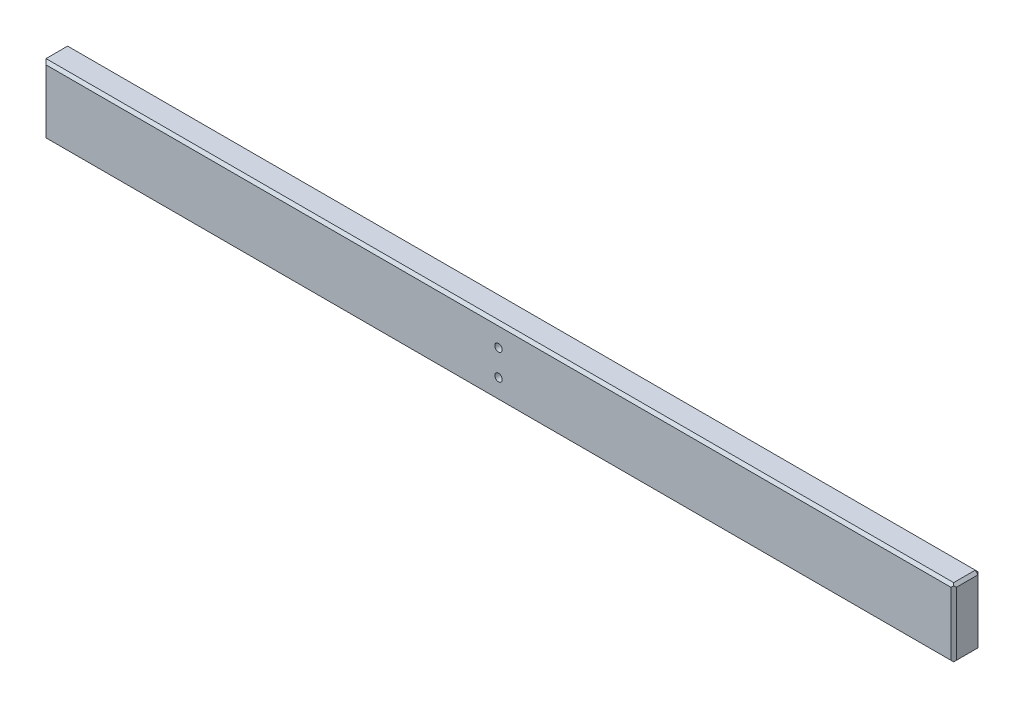
ISO-10303-21;
HEADER;
FILE_DESCRIPTION(('STEP AP214'),'2;1');
FILE_NAME('part.step','',(''),(''),'','','');
FILE_SCHEMA(('AUTOMOTIVE_DESIGN { 1 0 10303 214 1 1 1 1 }'));
ENDSEC;
DATA;
#1=APPLICATION_CONTEXT('core data for automotive mechanical design processes');
#2=APPLICATION_PROTOCOL_DEFINITION('international standard','automotive_design',2000,#1);
#3=PRODUCT_CONTEXT('',#1,'mechanical');
#4=PRODUCT('Part','Part','',(#3));
#5=PRODUCT_RELATED_PRODUCT_CATEGORY('part','',(#4));
#6=PRODUCT_DEFINITION_FORMATION('','',#4);
#7=PRODUCT_DEFINITION_CONTEXT('part definition',#1,'design');
#8=PRODUCT_DEFINITION('design','',#6,#7);
#9=PRODUCT_DEFINITION_SHAPE('','',#8);
#10=(LENGTH_UNIT() NAMED_UNIT(*) SI_UNIT(.MILLI.,.METRE.));
#11=(NAMED_UNIT(*) PLANE_ANGLE_UNIT() SI_UNIT($,.RADIAN.));
#12=(NAMED_UNIT(*) SI_UNIT($,.STERADIAN.) SOLID_ANGLE_UNIT());
#13=UNCERTAINTY_MEASURE_WITH_UNIT(LENGTH_MEASURE(1.E-05),#10,'distance_accuracy_value','');
#14=(GEOMETRIC_REPRESENTATION_CONTEXT(3) GLOBAL_UNCERTAINTY_ASSIGNED_CONTEXT((#13)) GLOBAL_UNIT_ASSIGNED_CONTEXT((#10,
#11,#12)) REPRESENTATION_CONTEXT('',''));
#15=CARTESIAN_POINT('',(0.,0.,0.));
#16=DIRECTION('',(0.,0.,1.));
#17=DIRECTION('',(1.,0.,0.));
#18=AXIS2_PLACEMENT_3D('',#15,#16,#17);
#19=CARTESIAN_POINT('',(336.7,25.4,20.));
#20=DIRECTION('',(-1.,0.,0.));
#21=DIRECTION('',(0.,0.,1.));
#22=AXIS2_PLACEMENT_3D('',#19,#20,#21);
#23=PLANE('',#22);
#24=DIRECTION('',(0.,-1.,0.));
#25=VECTOR('',#24,1.);
#26=CARTESIAN_POINT('',(336.7,-25.4,18.));
#27=LINE('',#26,#25);
#28=CARTESIAN_POINT('',(336.7,23.4,18.));
#29=VERTEX_POINT('',#28);
#30=CARTESIAN_POINT('',(336.7,-23.4000000000001,18.));
#31=VERTEX_POINT('',#30);
#32=EDGE_CURVE('E146',#29,#31,#27,.T.);
#33=ORIENTED_EDGE('',*,*,#32,.T.);
#34=DIRECTION('',(0.,0.,-1.));
#35=VECTOR('',#34,1.);
#36=CARTESIAN_POINT('',(336.7,-23.4000000000001,20.));
#37=LINE('',#36,#35);
#38=CARTESIAN_POINT('',(336.7,-23.4000000000001,1.99999999999995));
#39=VERTEX_POINT('',#38);
#40=EDGE_CURVE('E119',#31,#39,#37,.T.);
#41=ORIENTED_EDGE('',*,*,#40,.T.);
#42=DIRECTION('',(0.,1.,0.));
#43=VECTOR('',#42,1.);
#44=CARTESIAN_POINT('',(336.7,25.4,1.99999999999995));
#45=LINE('',#44,#43);
#46=CARTESIAN_POINT('',(336.7,23.4,1.99999999999995));
#47=VERTEX_POINT('',#46);
#48=EDGE_CURVE('E136',#39,#47,#45,.T.);
#49=ORIENTED_EDGE('',*,*,#48,.T.);
#50=DIRECTION('',(0.,0.,1.));
#51=VECTOR('',#50,1.);
#52=CARTESIAN_POINT('',(336.7,23.4,20.));
#53=LINE('',#52,#51);
#54=EDGE_CURVE('E142',#47,#29,#53,.T.);
#55=ORIENTED_EDGE('',*,*,#54,.T.);
#56=EDGE_LOOP('',(#33,#41,#49,#55));
#57=FACE_BOUND('',#56,.T.);
#58=ADVANCED_FACE('F32',(#57),#23,.F.);
#59=CARTESIAN_POINT('',(-336.7,25.4,20.));
#60=DIRECTION('',(0.,-1.,0.));
#61=DIRECTION('',(0.,0.,-1.));
#62=AXIS2_PLACEMENT_3D('',#59,#60,#61);
#63=PLANE('',#62);
#64=DIRECTION('',(0.,0.,-1.));
#65=VECTOR('',#64,1.);
#66=CARTESIAN_POINT('',(-336.7,25.4,20.));
#67=LINE('',#66,#65);
#68=CARTESIAN_POINT('',(-336.7,25.4,18.));
#69=VERTEX_POINT('',#68);
#70=CARTESIAN_POINT('',(-336.7,25.4,1.99999999999995));
#71=VERTEX_POINT('',#70);
#72=EDGE_CURVE('E143',#69,#71,#67,.T.);
#73=ORIENTED_EDGE('',*,*,#72,.F.);
#74=DIRECTION('',(1.,0.,0.));
#75=VECTOR('',#74,1.);
#76=CARTESIAN_POINT('',(334.7,25.4,18.));
#77=LINE('',#76,#75);
#78=CARTESIAN_POINT('',(334.7,25.4,18.));
#79=VERTEX_POINT('',#78);
#80=EDGE_CURVE('E200',#69,#79,#77,.T.);
#81=ORIENTED_EDGE('',*,*,#80,.T.);
#82=DIRECTION('',(0.,0.,-1.));
#83=VECTOR('',#82,1.);
#84=CARTESIAN_POINT('',(334.7,25.4,20.));
#85=LINE('',#84,#83);
#86=CARTESIAN_POINT('',(334.7,25.4,1.99999999999995));
#87=VERTEX_POINT('',#86);
#88=EDGE_CURVE('E161',#79,#87,#85,.T.);
#89=ORIENTED_EDGE('',*,*,#88,.T.);
#90=DIRECTION('',(-1.,0.,0.));
#91=VECTOR('',#90,1.);
#92=CARTESIAN_POINT('',(-336.7,25.4,1.99999999999995));
#93=LINE('',#92,#91);
#94=EDGE_CURVE('E158',#87,#71,#93,.T.);
#95=ORIENTED_EDGE('',*,*,#94,.T.);
#96=EDGE_LOOP('',(#73,#81,#89,#95));
#97=FACE_BOUND('',#96,.T.);
#98=ADVANCED_FACE('F240',(#97),#63,.F.);
#99=CARTESIAN_POINT('',(-336.7,25.4,20.));
#100=DIRECTION('',(1.,0.,0.));
#101=DIRECTION('',(0.,0.,-1.));
#102=AXIS2_PLACEMENT_3D('',#99,#100,#101);
#103=PLANE('',#102);
#104=DIRECTION('',(0.,0.,-1.));
#105=VECTOR('',#104,1.);
#106=CARTESIAN_POINT('',(-336.7,-25.4,20.));
#107=LINE('',#106,#105);
#108=CARTESIAN_POINT('',(-336.7,-25.4,18.));
#109=VERTEX_POINT('',#108);
#110=CARTESIAN_POINT('',(-336.7,-25.4,1.99999999999995));
#111=VERTEX_POINT('',#110);
#112=EDGE_CURVE('E259',#109,#111,#107,.T.);
#113=ORIENTED_EDGE('',*,*,#112,.F.);
#114=DIRECTION('',(0.,1.,0.));
#115=VECTOR('',#114,1.);
#116=CARTESIAN_POINT('',(-336.7,25.4,18.));
#117=LINE('',#116,#115);
#118=EDGE_CURVE('E208',#109,#69,#117,.T.);
#119=ORIENTED_EDGE('',*,*,#118,.T.);
#120=ORIENTED_EDGE('',*,*,#72,.T.);
#121=DIRECTION('',(0.,-1.,0.));
#122=VECTOR('',#121,1.);
#123=CARTESIAN_POINT('',(-336.7,25.4,1.99999999999995));
#124=LINE('',#123,#122);
#125=EDGE_CURVE('E172',#71,#111,#124,.T.);
#126=ORIENTED_EDGE('',*,*,#125,.T.);
#127=EDGE_LOOP('',(#113,#119,#120,#126));
#128=FACE_BOUND('',#127,.T.);
#129=ADVANCED_FACE('F258',(#128),#103,.F.);
#130=CARTESIAN_POINT('',(-336.7,-25.4,20.));
#131=DIRECTION('',(0.,1.,0.));
#132=DIRECTION('',(0.,0.,1.));
#133=AXIS2_PLACEMENT_3D('',#130,#131,#132);
#134=PLANE('',#133);
#135=DIRECTION('',(0.,0.,1.));
#136=VECTOR('',#135,1.);
#137=CARTESIAN_POINT('',(334.7,-25.4,20.));
#138=LINE('',#137,#136);
#139=CARTESIAN_POINT('',(334.7,-25.4,1.99999999999995));
#140=VERTEX_POINT('',#139);
#141=CARTESIAN_POINT('',(334.7,-25.4,18.));
#142=VERTEX_POINT('',#141);
#143=EDGE_CURVE('E120',#140,#142,#138,.T.);
#144=ORIENTED_EDGE('',*,*,#143,.T.);
#145=DIRECTION('',(-1.,0.,0.));
#146=VECTOR('',#145,1.);
#147=CARTESIAN_POINT('',(-336.7,-25.4,18.));
#148=LINE('',#147,#146);
#149=EDGE_CURVE('E11',#142,#109,#148,.T.);
#150=ORIENTED_EDGE('',*,*,#149,.T.);
#151=ORIENTED_EDGE('',*,*,#112,.T.);
#152=DIRECTION('',(1.,0.,0.));
#153=VECTOR('',#152,1.);
#154=CARTESIAN_POINT('',(-336.7,-25.4,1.99999999999995));
#155=LINE('',#154,#153);
#156=EDGE_CURVE('E148',#111,#140,#155,.T.);
#157=ORIENTED_EDGE('',*,*,#156,.T.);
#158=EDGE_LOOP('',(#144,#150,#151,#157));
#159=FACE_BOUND('',#158,.T.);
#160=ADVANCED_FACE('F393',(#159),#134,.F.);
#161=CARTESIAN_POINT('',(0.,0.,20.));
#162=DIRECTION('',(0.,0.,1.));
#163=DIRECTION('',(1.,0.,0.));
#164=AXIS2_PLACEMENT_3D('',#161,#162,#163);
#165=PLANE('',#164);
#166=CARTESIAN_POINT('',(0.,9.55,20.));
#167=DIRECTION('',(0.,0.,-1.));
#168=DIRECTION('',(-1.,0.,0.));
#169=AXIS2_PLACEMENT_3D('',#166,#167,#168);
#170=CIRCLE('',#169,2.75);
#171=CARTESIAN_POINT('',(-2.75,9.55,20.));
#172=VERTEX_POINT('',#171);
#173=EDGE_CURVE('E261',#172,#172,#170,.T.);
#174=ORIENTED_EDGE('',*,*,#173,.T.);
#175=EDGE_LOOP('',(#174));
#176=FACE_BOUND('',#175,.T.);
#177=CARTESIAN_POINT('',(0.,-9.55,20.));
#178=DIRECTION('',(0.,0.,-1.));
#179=DIRECTION('',(-1.,0.,0.));
#180=AXIS2_PLACEMENT_3D('',#177,#178,#179);
#181=CIRCLE('',#180,2.75);
#182=CARTESIAN_POINT('',(-2.75,-9.55,20.));
#183=VERTEX_POINT('',#182);
#184=EDGE_CURVE('E266',#183,#183,#181,.T.);
#185=ORIENTED_EDGE('',*,*,#184,.T.);
#186=EDGE_LOOP('',(#185));
#187=FACE_BOUND('',#186,.T.);
#188=DIRECTION('',(0.,1.,0.));
#189=VECTOR('',#188,1.);
#190=CARTESIAN_POINT('',(334.7,25.4,20.));
#191=LINE('',#190,#189);
#192=CARTESIAN_POINT('',(334.7,-23.4000000000001,20.));
#193=VERTEX_POINT('',#192);
#194=CARTESIAN_POINT('',(334.7,23.4000000000001,20.));
#195=VERTEX_POINT('',#194);
#196=EDGE_CURVE('E155',#193,#195,#191,.T.);
#197=ORIENTED_EDGE('',*,*,#196,.T.);
#198=DIRECTION('',(-1.,0.,0.));
#199=VECTOR('',#198,1.);
#200=CARTESIAN_POINT('',(-336.7,23.4000000000001,20.));
#201=LINE('',#200,#199);
#202=CARTESIAN_POINT('',(-334.7,23.4000000000001,20.));
#203=VERTEX_POINT('',#202);
#204=EDGE_CURVE('E197',#195,#203,#201,.T.);
#205=ORIENTED_EDGE('',*,*,#204,.T.);
#206=DIRECTION('',(0.,-1.,0.));
#207=VECTOR('',#206,1.);
#208=CARTESIAN_POINT('',(-334.7,-25.4,20.));
#209=LINE('',#208,#207);
#210=CARTESIAN_POINT('',(-334.7,-23.4000000000001,20.));
#211=VERTEX_POINT('',#210);
#212=EDGE_CURVE('E195',#203,#211,#209,.T.);
#213=ORIENTED_EDGE('',*,*,#212,.T.);
#214=DIRECTION('',(1.,0.,0.));
#215=VECTOR('',#214,1.);
#216=CARTESIAN_POINT('',(334.7,-23.4000000000001,20.));
#217=LINE('',#216,#215);
#218=EDGE_CURVE('E174',#211,#193,#217,.T.);
#219=ORIENTED_EDGE('',*,*,#218,.T.);
#220=EDGE_LOOP('',(#197,#205,#213,#219));
#221=FACE_BOUND('',#220,.T.);
#222=ADVANCED_FACE('F226',(#176,#187,#221),#165,.T.);
#223=CARTESIAN_POINT('',(0.,0.,0.));
#224=DIRECTION('',(0.,0.,1.));
#225=DIRECTION('',(1.,0.,0.));
#226=AXIS2_PLACEMENT_3D('',#223,#224,#225);
#227=PLANE('',#226);
#228=DIRECTION('',(1.,0.,0.));
#229=VECTOR('',#228,1.);
#230=CARTESIAN_POINT('',(0.,23.4,0.));
#231=LINE('',#230,#229);
#232=CARTESIAN_POINT('',(-334.7,23.4,0.));
#233=VERTEX_POINT('',#232);
#234=CARTESIAN_POINT('',(334.7,23.4,0.));
#235=VERTEX_POINT('',#234);
#236=EDGE_CURVE('E163',#233,#235,#231,.T.);
#237=ORIENTED_EDGE('',*,*,#236,.T.);
#238=DIRECTION('',(0.,-1.,0.));
#239=VECTOR('',#238,1.);
#240=CARTESIAN_POINT('',(334.7,0.,0.));
#241=LINE('',#240,#239);
#242=CARTESIAN_POINT('',(334.7,-23.4,0.));
#243=VERTEX_POINT('',#242);
#244=EDGE_CURVE('E169',#235,#243,#241,.T.);
#245=ORIENTED_EDGE('',*,*,#244,.T.);
#246=DIRECTION('',(-1.,0.,0.));
#247=VECTOR('',#246,1.);
#248=CARTESIAN_POINT('',(0.,-23.4,0.));
#249=LINE('',#248,#247);
#250=CARTESIAN_POINT('',(-334.7,-23.4,0.));
#251=VERTEX_POINT('',#250);
#252=EDGE_CURVE('E167',#243,#251,#249,.T.);
#253=ORIENTED_EDGE('',*,*,#252,.T.);
#254=DIRECTION('',(0.,1.,0.));
#255=VECTOR('',#254,1.);
#256=CARTESIAN_POINT('',(-334.7,0.,0.));
#257=LINE('',#256,#255);
#258=EDGE_CURVE('E165',#251,#233,#257,.T.);
#259=ORIENTED_EDGE('',*,*,#258,.T.);
#260=EDGE_LOOP('',(#237,#245,#253,#259));
#261=FACE_BOUND('',#260,.T.);
#262=CARTESIAN_POINT('',(0.,9.55,0.));
#263=DIRECTION('',(0.,0.,-1.));
#264=DIRECTION('',(-1.,0.,0.));
#265=AXIS2_PLACEMENT_3D('',#262,#263,#264);
#266=CIRCLE('',#265,2.75);
#267=CARTESIAN_POINT('',(-2.75,9.55,0.));
#268=VERTEX_POINT('',#267);
#269=EDGE_CURVE('E269',#268,#268,#266,.T.);
#270=ORIENTED_EDGE('',*,*,#269,.F.);
#271=EDGE_LOOP('',(#270));
#272=FACE_BOUND('',#271,.T.);
#273=CARTESIAN_POINT('',(0.,-9.55,0.));
#274=DIRECTION('',(0.,0.,-1.));
#275=DIRECTION('',(-1.,0.,0.));
#276=AXIS2_PLACEMENT_3D('',#273,#274,#275);
#277=CIRCLE('',#276,2.75);
#278=CARTESIAN_POINT('',(-2.75,-9.55,0.));
#279=VERTEX_POINT('',#278);
#280=EDGE_CURVE('E193',#279,#279,#277,.T.);
#281=ORIENTED_EDGE('',*,*,#280,.F.);
#282=EDGE_LOOP('',(#281));
#283=FACE_BOUND('',#282,.T.);
#284=ADVANCED_FACE('F250',(#261,#272,#283),#227,.F.);
#285=CARTESIAN_POINT('',(0.,-9.55,20.));
#286=DIRECTION('',(0.,0.,-1.));
#287=DIRECTION('',(-1.,0.,0.));
#288=AXIS2_PLACEMENT_3D('',#285,#286,#287);
#289=CYLINDRICAL_SURFACE('',#288,2.75);
#290=ORIENTED_EDGE('',*,*,#184,.F.);
#291=EDGE_LOOP('',(#290));
#292=FACE_BOUND('',#291,.T.);
#293=ORIENTED_EDGE('',*,*,#280,.T.);
#294=EDGE_LOOP('',(#293));
#295=FACE_BOUND('',#294,.T.);
#296=ADVANCED_FACE('F280',(#292,#295),#289,.F.);
#297=CARTESIAN_POINT('',(0.,9.55,20.));
#298=DIRECTION('',(0.,0.,-1.));
#299=DIRECTION('',(-1.,0.,0.));
#300=AXIS2_PLACEMENT_3D('',#297,#298,#299);
#301=CYLINDRICAL_SURFACE('',#300,2.75);
#302=ORIENTED_EDGE('',*,*,#173,.F.);
#303=EDGE_LOOP('',(#302));
#304=FACE_BOUND('',#303,.T.);
#305=ORIENTED_EDGE('',*,*,#269,.T.);
#306=EDGE_LOOP('',(#305));
#307=FACE_BOUND('',#306,.T.);
#308=ADVANCED_FACE('F277',(#304,#307),#301,.F.);
#309=CARTESIAN_POINT('',(-336.7,25.4,1.99999999999995));
#310=DIRECTION('',(0.,-0.707106781186538,0.707106781186557));
#311=DIRECTION('',(-1.,0.,0.));
#312=AXIS2_PLACEMENT_3D('',#309,#310,#311);
#313=PLANE('',#312);
#314=DIRECTION('',(0.,-0.707106781186557,-0.707106781186538));
#315=VECTOR('',#314,1.);
#316=CARTESIAN_POINT('',(334.7,25.4,1.99999999999995));
#317=LINE('',#316,#315);
#318=EDGE_CURVE('E190',#235,#87,#317,.F.);
#319=ORIENTED_EDGE('',*,*,#318,.F.);
#320=ORIENTED_EDGE('',*,*,#236,.F.);
#321=DIRECTION('',(-0.577350269189631,0.577350269189631,0.577350269189615));
#322=VECTOR('',#321,1.);
#323=CARTESIAN_POINT('',(-336.7,25.4,1.99999999999995));
#324=LINE('',#323,#322);
#325=EDGE_CURVE('E187',#71,#233,#324,.F.);
#326=ORIENTED_EDGE('',*,*,#325,.F.);
#327=ORIENTED_EDGE('',*,*,#94,.F.);
#328=EDGE_LOOP('',(#319,#320,#326,#327));
#329=FACE_BOUND('',#328,.T.);
#330=ADVANCED_FACE('F244',(#329),#313,.F.);
#331=CARTESIAN_POINT('',(334.7,25.4,1.99999999999995));
#332=DIRECTION('',(0.57735026918962,0.57735026918962,-0.577350269189636));
#333=DIRECTION('',(-0.707106781186557,0.,-0.707106781186538));
#334=AXIS2_PLACEMENT_3D('',#331,#332,#333);
#335=PLANE('',#334);
#336=DIRECTION('',(0.707106781186557,0.,0.707106781186538));
#337=VECTOR('',#336,1.);
#338=CARTESIAN_POINT('',(335.7,23.4,0.999999999999945));
#339=LINE('',#338,#337);
#340=EDGE_CURVE('E139',#235,#47,#339,.T.);
#341=ORIENTED_EDGE('',*,*,#340,.F.);
#342=ORIENTED_EDGE('',*,*,#318,.T.);
#343=DIRECTION('',(-0.707106781186547,0.707106781186547,0.));
#344=VECTOR('',#343,1.);
#345=CARTESIAN_POINT('',(334.7,25.4,1.99999999999995));
#346=LINE('',#345,#344);
#347=EDGE_CURVE('E184',#47,#87,#346,.T.);
#348=ORIENTED_EDGE('',*,*,#347,.F.);
#349=EDGE_LOOP('',(#341,#342,#348));
#350=FACE_BOUND('',#349,.T.);
#351=ADVANCED_FACE('F248',(#350),#335,.T.);
#352=CARTESIAN_POINT('',(-336.7,25.4,1.99999999999995));
#353=DIRECTION('',(0.707106781186538,0.,0.707106781186557));
#354=DIRECTION('',(0.,-1.,0.));
#355=AXIS2_PLACEMENT_3D('',#352,#353,#354);
#356=PLANE('',#355);
#357=ORIENTED_EDGE('',*,*,#325,.T.);
#358=ORIENTED_EDGE('',*,*,#258,.F.);
#359=DIRECTION('',(-0.577350269189631,-0.577350269189631,0.577350269189615));
#360=VECTOR('',#359,1.);
#361=CARTESIAN_POINT('',(-319.766666666666,-8.46666666666635,-14.9333333333332));
#362=LINE('',#361,#360);
#363=EDGE_CURVE('E180',#111,#251,#362,.F.);
#364=ORIENTED_EDGE('',*,*,#363,.F.);
#365=ORIENTED_EDGE('',*,*,#125,.F.);
#366=EDGE_LOOP('',(#357,#358,#364,#365));
#367=FACE_BOUND('',#366,.T.);
#368=ADVANCED_FACE('F254',(#367),#356,.F.);
#369=CARTESIAN_POINT('',(334.7,25.4,20.));
#370=DIRECTION('',(-0.707106781186547,-0.707106781186547,0.));
#371=DIRECTION('',(0.,0.,-1.));
#372=AXIS2_PLACEMENT_3D('',#369,#370,#371);
#373=PLANE('',#372);
#374=ORIENTED_EDGE('',*,*,#88,.F.);
#375=DIRECTION('',(-0.577350269189621,0.577350269189621,-0.577350269189637));
#376=VECTOR('',#375,1.);
#377=CARTESIAN_POINT('',(335.366666666667,24.7333333333333,18.6666666666667));
#378=LINE('',#377,#376);
#379=CARTESIAN_POINT('',(335.7,24.4,19.));
#380=VERTEX_POINT('',#379);
#381=EDGE_CURVE('E202',#79,#380,#378,.F.);
#382=ORIENTED_EDGE('',*,*,#381,.T.);
#383=DIRECTION('',(-0.577350269189621,0.577350269189621,0.577350269189637));
#384=VECTOR('',#383,1.);
#385=CARTESIAN_POINT('',(334.7,25.4,20.));
#386=LINE('',#385,#384);
#387=EDGE_CURVE('E133',#29,#380,#386,.T.);
#388=ORIENTED_EDGE('',*,*,#387,.F.);
#389=ORIENTED_EDGE('',*,*,#54,.F.);
#390=ORIENTED_EDGE('',*,*,#347,.T.);
#391=EDGE_LOOP('',(#374,#382,#388,#389,#390));
#392=FACE_BOUND('',#391,.T.);
#393=ADVANCED_FACE('F235',(#392),#373,.F.);
#394=CARTESIAN_POINT('',(336.7,25.4,1.99999999999995));
#395=DIRECTION('',(-0.707106781186538,0.,0.707106781186557));
#396=DIRECTION('',(0.,1.,0.));
#397=AXIS2_PLACEMENT_3D('',#394,#395,#396);
#398=PLANE('',#397);
#399=ORIENTED_EDGE('',*,*,#340,.T.);
#400=ORIENTED_EDGE('',*,*,#48,.F.);
#401=DIRECTION('',(-0.707106781186557,0.,-0.707106781186538));
#402=VECTOR('',#401,1.);
#403=CARTESIAN_POINT('',(336.7,-23.4000000000001,1.99999999999995));
#404=LINE('',#403,#402);
#405=EDGE_CURVE('E125',#243,#39,#404,.F.);
#406=ORIENTED_EDGE('',*,*,#405,.F.);
#407=ORIENTED_EDGE('',*,*,#244,.F.);
#408=EDGE_LOOP('',(#399,#400,#406,#407));
#409=FACE_BOUND('',#408,.T.);
#410=ADVANCED_FACE('F137',(#409),#398,.F.);
#411=CARTESIAN_POINT('',(-336.7,-25.4,1.99999999999995));
#412=DIRECTION('',(0.,0.707106781186538,0.707106781186557));
#413=DIRECTION('',(1.,0.,0.));
#414=AXIS2_PLACEMENT_3D('',#411,#412,#413);
#415=PLANE('',#414);
#416=ORIENTED_EDGE('',*,*,#363,.T.);
#417=ORIENTED_EDGE('',*,*,#252,.F.);
#418=DIRECTION('',(0.,-0.707106781186557,0.707106781186538));
#419=VECTOR('',#418,1.);
#420=CARTESIAN_POINT('',(334.7,-24.4,0.999999999999973));
#421=LINE('',#420,#419);
#422=EDGE_CURVE('E129',#140,#243,#421,.F.);
#423=ORIENTED_EDGE('',*,*,#422,.F.);
#424=ORIENTED_EDGE('',*,*,#156,.F.);
#425=EDGE_LOOP('',(#416,#417,#423,#424));
#426=FACE_BOUND('',#425,.T.);
#427=ADVANCED_FACE('F309',(#426),#415,.F.);
#428=CARTESIAN_POINT('',(334.7,0.,20.));
#429=DIRECTION('',(0.707106781186557,0.,0.707106781186538));
#430=DIRECTION('',(0.,-1.,0.));
#431=AXIS2_PLACEMENT_3D('',#428,#429,#430);
#432=PLANE('',#431);
#433=ORIENTED_EDGE('',*,*,#387,.T.);
#434=DIRECTION('',(-0.57735026918962,-0.57735026918962,0.577350269189636));
#435=VECTOR('',#434,1.);
#436=CARTESIAN_POINT('',(326.9,15.6000000000002,27.8000000000001));
#437=LINE('',#436,#435);
#438=EDGE_CURVE('E206',#380,#195,#437,.T.);
#439=ORIENTED_EDGE('',*,*,#438,.T.);
#440=ORIENTED_EDGE('',*,*,#196,.F.);
#441=DIRECTION('',(0.57735026918962,-0.57735026918962,-0.577350269189636));
#442=VECTOR('',#441,1.);
#443=CARTESIAN_POINT('',(326.9,-15.6000000000002,27.8000000000001));
#444=LINE('',#443,#442);
#445=CARTESIAN_POINT('',(335.7,-24.4,19.));
#446=VERTEX_POINT('',#445);
#447=EDGE_CURVE('E204',#193,#446,#444,.T.);
#448=ORIENTED_EDGE('',*,*,#447,.T.);
#449=DIRECTION('',(-0.577350269189626,-0.57735026918961,0.577350269189642));
#450=VECTOR('',#449,1.);
#451=CARTESIAN_POINT('',(343.166666666666,-16.9333333333338,11.5333333333334));
#452=LINE('',#451,#450);
#453=EDGE_CURVE('E122',#31,#446,#452,.T.);
#454=ORIENTED_EDGE('',*,*,#453,.F.);
#455=ORIENTED_EDGE('',*,*,#32,.F.);
#456=EDGE_LOOP('',(#433,#439,#440,#448,#454,#455));
#457=FACE_BOUND('',#456,.T.);
#458=ADVANCED_FACE('F228',(#457),#432,.T.);
#459=CARTESIAN_POINT('',(336.7,-23.4000000000001,1.99999999999995));
#460=DIRECTION('',(0.57735026918961,-0.577350269189626,-0.577350269189642));
#461=DIRECTION('',(0.,0.707106781186557,-0.707106781186538));
#462=AXIS2_PLACEMENT_3D('',#459,#460,#461);
#463=PLANE('',#462);
#464=ORIENTED_EDGE('',*,*,#422,.T.);
#465=ORIENTED_EDGE('',*,*,#405,.T.);
#466=DIRECTION('',(0.707106781186557,0.707106781186538,0.));
#467=VECTOR('',#466,1.);
#468=CARTESIAN_POINT('',(336.7,-23.4000000000001,1.99999999999995));
#469=LINE('',#468,#467);
#470=EDGE_CURVE('E115',#140,#39,#469,.T.);
#471=ORIENTED_EDGE('',*,*,#470,.F.);
#472=EDGE_LOOP('',(#464,#465,#471));
#473=FACE_BOUND('',#472,.T.);
#474=ADVANCED_FACE('F127',(#473),#463,.T.);
#475=CARTESIAN_POINT('',(336.7,-23.4000000000001,20.));
#476=DIRECTION('',(-0.707106781186538,0.707106781186557,0.));
#477=DIRECTION('',(0.,0.,-1.));
#478=AXIS2_PLACEMENT_3D('',#475,#476,#477);
#479=PLANE('',#478);
#480=ORIENTED_EDGE('',*,*,#453,.T.);
#481=DIRECTION('',(0.577350269189631,0.577350269189615,0.577350269189631));
#482=VECTOR('',#481,1.);
#483=CARTESIAN_POINT('',(336.7,-23.4000000000001,20.));
#484=LINE('',#483,#482);
#485=EDGE_CURVE('E41',#446,#142,#484,.F.);
#486=ORIENTED_EDGE('',*,*,#485,.T.);
#487=ORIENTED_EDGE('',*,*,#143,.F.);
#488=ORIENTED_EDGE('',*,*,#470,.T.);
#489=ORIENTED_EDGE('',*,*,#40,.F.);
#490=EDGE_LOOP('',(#480,#486,#487,#488,#489));
#491=FACE_BOUND('',#490,.T.);
#492=ADVANCED_FACE('F117',(#491),#479,.F.);
#493=CARTESIAN_POINT('',(0.,-23.4000000000001,20.));
#494=DIRECTION('',(0.,-0.707106781186557,0.707106781186538));
#495=DIRECTION('',(-1.,0.,0.));
#496=AXIS2_PLACEMENT_3D('',#493,#494,#495);
#497=PLANE('',#496);
#498=ORIENTED_EDGE('',*,*,#447,.F.);
#499=ORIENTED_EDGE('',*,*,#218,.F.);
#500=DIRECTION('',(-0.57735026918962,-0.57735026918962,-0.577350269189636));
#501=VECTOR('',#500,1.);
#502=CARTESIAN_POINT('',(-223.133333333335,88.1666666666646,131.566666666668));
#503=LINE('',#502,#501);
#504=EDGE_CURVE('E36',#109,#211,#503,.F.);
#505=ORIENTED_EDGE('',*,*,#504,.F.);
#506=ORIENTED_EDGE('',*,*,#149,.F.);
#507=ORIENTED_EDGE('',*,*,#485,.F.);
#508=EDGE_LOOP('',(#498,#499,#505,#506,#507));
#509=FACE_BOUND('',#508,.T.);
#510=ADVANCED_FACE('F34',(#509),#497,.T.);
#511=CARTESIAN_POINT('',(-334.7,0.,20.));
#512=DIRECTION('',(-0.707106781186557,0.,0.707106781186538));
#513=DIRECTION('',(0.,1.,0.));
#514=AXIS2_PLACEMENT_3D('',#511,#512,#513);
#515=PLANE('',#514);
#516=ORIENTED_EDGE('',*,*,#504,.T.);
#517=ORIENTED_EDGE('',*,*,#212,.F.);
#518=DIRECTION('',(-0.57735026918962,0.57735026918962,-0.577350269189636));
#519=VECTOR('',#518,1.);
#520=CARTESIAN_POINT('',(-326.9,15.6000000000002,27.8000000000001));
#521=LINE('',#520,#519);
#522=EDGE_CURVE('E210',#69,#203,#521,.F.);
#523=ORIENTED_EDGE('',*,*,#522,.F.);
#524=ORIENTED_EDGE('',*,*,#118,.F.);
#525=EDGE_LOOP('',(#516,#517,#523,#524));
#526=FACE_BOUND('',#525,.T.);
#527=ADVANCED_FACE('F220',(#526),#515,.T.);
#528=CARTESIAN_POINT('',(0.,23.4000000000001,20.));
#529=DIRECTION('',(0.,0.707106781186557,0.707106781186538));
#530=DIRECTION('',(1.,0.,0.));
#531=AXIS2_PLACEMENT_3D('',#528,#529,#530);
#532=PLANE('',#531);
#533=ORIENTED_EDGE('',*,*,#381,.F.);
#534=ORIENTED_EDGE('',*,*,#80,.F.);
#535=ORIENTED_EDGE('',*,*,#522,.T.);
#536=ORIENTED_EDGE('',*,*,#204,.F.);
#537=ORIENTED_EDGE('',*,*,#438,.F.);
#538=EDGE_LOOP('',(#533,#534,#535,#536,#537));
#539=FACE_BOUND('',#538,.T.);
#540=ADVANCED_FACE('F232',(#539),#532,.T.);
#541=CLOSED_SHELL('',(#58,#98,#129,#160,#222,#284,#296,#308,#330,#351,#368,#393,#410,#427,#458,
#474,#492,#510,#527,#540));
#542=MANIFOLD_SOLID_BREP('B2',#541);
#543=ADVANCED_BREP_SHAPE_REPRESENTATION('',(#18,#542),#14);
#544=SHAPE_DEFINITION_REPRESENTATION(#9,#543);
ENDSEC;
END-ISO-10303-21;
